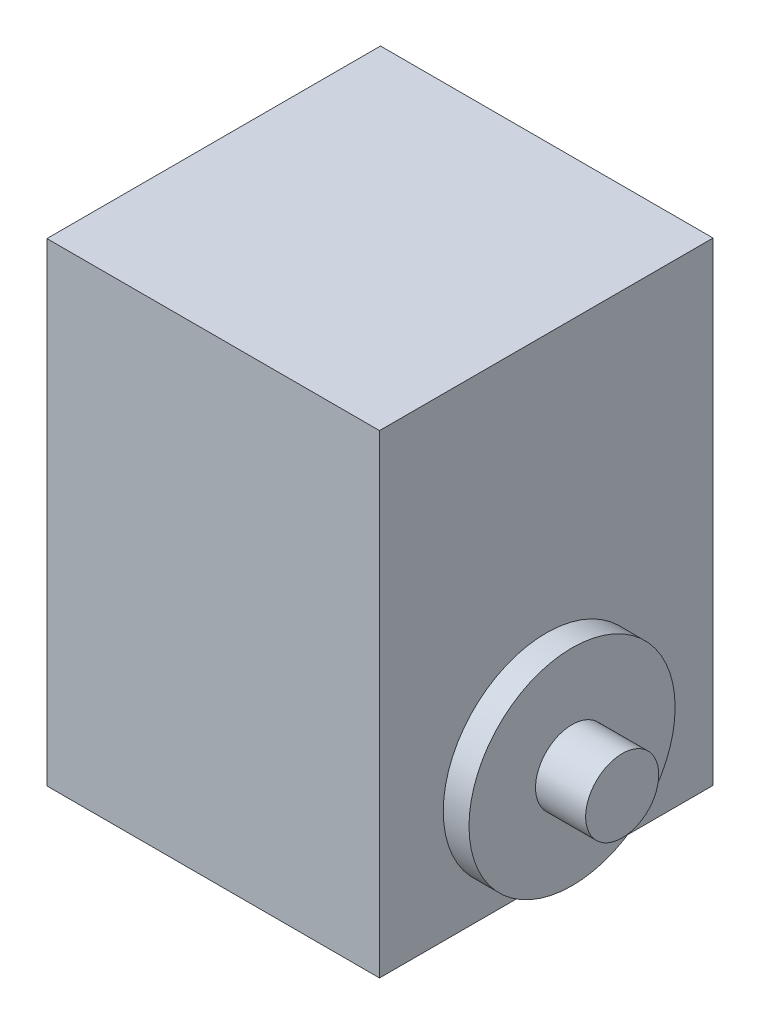
ISO-10303-21;
HEADER;
FILE_DESCRIPTION(('STEP AP214'),'2;1');
FILE_NAME('part.step','',(''),(''),'','','');
FILE_SCHEMA(('AUTOMOTIVE_DESIGN { 1 0 10303 214 1 1 1 1 }'));
ENDSEC;
DATA;
#1=APPLICATION_CONTEXT('core data for automotive mechanical design processes');
#2=APPLICATION_PROTOCOL_DEFINITION('international standard','automotive_design',2000,#1);
#3=PRODUCT_CONTEXT('',#1,'mechanical');
#4=PRODUCT('Part','Part','',(#3));
#5=PRODUCT_RELATED_PRODUCT_CATEGORY('part','',(#4));
#6=PRODUCT_DEFINITION_FORMATION('','',#4);
#7=PRODUCT_DEFINITION_CONTEXT('part definition',#1,'design');
#8=PRODUCT_DEFINITION('design','',#6,#7);
#9=PRODUCT_DEFINITION_SHAPE('','',#8);
#10=(LENGTH_UNIT() NAMED_UNIT(*) SI_UNIT(.MILLI.,.METRE.));
#11=(NAMED_UNIT(*) PLANE_ANGLE_UNIT() SI_UNIT($,.RADIAN.));
#12=(NAMED_UNIT(*) SI_UNIT($,.STERADIAN.) SOLID_ANGLE_UNIT());
#13=UNCERTAINTY_MEASURE_WITH_UNIT(LENGTH_MEASURE(1.E-05),#10,'distance_accuracy_value','');
#14=(GEOMETRIC_REPRESENTATION_CONTEXT(3) GLOBAL_UNCERTAINTY_ASSIGNED_CONTEXT((#13)) GLOBAL_UNIT_ASSIGNED_CONTEXT((#10,
#11,#12)) REPRESENTATION_CONTEXT('',''));
#15=CARTESIAN_POINT('',(0.,0.,0.));
#16=DIRECTION('',(0.,0.,1.));
#17=DIRECTION('',(1.,0.,0.));
#18=AXIS2_PLACEMENT_3D('',#15,#16,#17);
#19=CARTESIAN_POINT('',(20.5,0.,0.));
#20=DIRECTION('',(1.,0.,0.));
#21=DIRECTION('',(0.,0.,-1.));
#22=AXIS2_PLACEMENT_3D('',#19,#20,#21);
#23=PLANE('',#22);
#24=CARTESIAN_POINT('',(20.5,0.,0.));
#25=DIRECTION('',(1.,0.,0.));
#26=DIRECTION('',(0.,0.,-1.));
#27=AXIS2_PLACEMENT_3D('',#24,#25,#26);
#28=CIRCLE('',#27,11.);
#29=CARTESIAN_POINT('',(20.5,0.,-11.));
#30=VERTEX_POINT('',#29);
#31=EDGE_CURVE('E104',#30,#30,#28,.T.);
#32=ORIENTED_EDGE('',*,*,#31,.T.);
#33=EDGE_LOOP('',(#32));
#34=FACE_BOUND('',#33,.T.);
#35=CARTESIAN_POINT('',(20.5,0.,0.));
#36=DIRECTION('',(1.,0.,0.));
#37=DIRECTION('',(0.,0.,-1.));
#38=AXIS2_PLACEMENT_3D('',#35,#36,#37);
#39=CIRCLE('',#38,3.90000000000001);
#40=CARTESIAN_POINT('',(20.5,0.,-3.90000000000001));
#41=VERTEX_POINT('',#40);
#42=EDGE_CURVE('E178',#41,#41,#39,.T.);
#43=ORIENTED_EDGE('',*,*,#42,.F.);
#44=EDGE_LOOP('',(#43));
#45=FACE_BOUND('',#44,.T.);
#46=ADVANCED_FACE('F32',(#34,#45),#23,.T.);
#47=CARTESIAN_POINT('',(17.75,38.6,17.8));
#48=DIRECTION('',(-1.,0.,0.));
#49=DIRECTION('',(0.,0.,1.));
#50=AXIS2_PLACEMENT_3D('',#47,#48,#49);
#51=PLANE('',#50);
#52=DIRECTION('',(0.,0.,-1.));
#53=VECTOR('',#52,1.);
#54=CARTESIAN_POINT('',(17.75,-12.,17.8));
#55=LINE('',#54,#53);
#56=CARTESIAN_POINT('',(17.75,-12.,17.8));
#57=VERTEX_POINT('',#56);
#58=CARTESIAN_POINT('',(17.75,-12.,-17.8));
#59=VERTEX_POINT('',#58);
#60=EDGE_CURVE('E66',#57,#59,#55,.T.);
#61=ORIENTED_EDGE('',*,*,#60,.T.);
#62=DIRECTION('',(0.,-1.,0.));
#63=VECTOR('',#62,1.);
#64=CARTESIAN_POINT('',(17.75,38.6,-17.8));
#65=LINE('',#64,#63);
#66=CARTESIAN_POINT('',(17.75,38.6,-17.8));
#67=VERTEX_POINT('',#66);
#68=EDGE_CURVE('E92',#67,#59,#65,.T.);
#69=ORIENTED_EDGE('',*,*,#68,.F.);
#70=DIRECTION('',(0.,0.,-1.));
#71=VECTOR('',#70,1.);
#72=CARTESIAN_POINT('',(17.75,38.6,17.8));
#73=LINE('',#72,#71);
#74=CARTESIAN_POINT('',(17.75,38.6,17.8));
#75=VERTEX_POINT('',#74);
#76=EDGE_CURVE('E83',#75,#67,#73,.T.);
#77=ORIENTED_EDGE('',*,*,#76,.F.);
#78=DIRECTION('',(0.,-1.,0.));
#79=VECTOR('',#78,1.);
#80=CARTESIAN_POINT('',(17.75,38.6,17.8));
#81=LINE('',#80,#79);
#82=EDGE_CURVE('E88',#75,#57,#81,.T.);
#83=ORIENTED_EDGE('',*,*,#82,.T.);
#84=EDGE_LOOP('',(#61,#69,#77,#83));
#85=FACE_BOUND('',#84,.T.);
#86=CARTESIAN_POINT('',(17.75,0.,0.));
#87=DIRECTION('',(-1.,0.,0.));
#88=DIRECTION('',(0.,0.,1.));
#89=AXIS2_PLACEMENT_3D('',#86,#87,#88);
#90=CIRCLE('',#89,11.);
#91=CARTESIAN_POINT('',(17.75,0.,11.));
#92=VERTEX_POINT('',#91);
#93=EDGE_CURVE('E41',#92,#92,#90,.F.);
#94=ORIENTED_EDGE('',*,*,#93,.F.);
#95=EDGE_LOOP('',(#94));
#96=FACE_BOUND('',#95,.T.);
#97=ADVANCED_FACE('F94',(#85,#96),#51,.F.);
#98=CARTESIAN_POINT('',(-17.75,38.6,17.8));
#99=DIRECTION('',(1.,0.,0.));
#100=DIRECTION('',(0.,0.,-1.));
#101=AXIS2_PLACEMENT_3D('',#98,#99,#100);
#102=PLANE('',#101);
#103=CARTESIAN_POINT('',(-17.75,0.,0.));
#104=DIRECTION('',(1.,0.,0.));
#105=DIRECTION('',(0.,0.,-1.));
#106=AXIS2_PLACEMENT_3D('',#103,#104,#105);
#107=CIRCLE('',#106,11.);
#108=CARTESIAN_POINT('',(-17.75,0.,-11.));
#109=VERTEX_POINT('',#108);
#110=EDGE_CURVE('E171',#109,#109,#107,.T.);
#111=ORIENTED_EDGE('',*,*,#110,.T.);
#112=EDGE_LOOP('',(#111));
#113=FACE_BOUND('',#112,.T.);
#114=DIRECTION('',(0.,0.,1.));
#115=VECTOR('',#114,1.);
#116=CARTESIAN_POINT('',(-17.75,-12.,17.8));
#117=LINE('',#116,#115);
#118=CARTESIAN_POINT('',(-17.75,-12.,-17.8));
#119=VERTEX_POINT('',#118);
#120=CARTESIAN_POINT('',(-17.75,-12.,17.8));
#121=VERTEX_POINT('',#120);
#122=EDGE_CURVE('E101',#119,#121,#117,.T.);
#123=ORIENTED_EDGE('',*,*,#122,.T.);
#124=DIRECTION('',(0.,-1.,0.));
#125=VECTOR('',#124,1.);
#126=CARTESIAN_POINT('',(-17.75,38.6,17.8));
#127=LINE('',#126,#125);
#128=CARTESIAN_POINT('',(-17.75,38.6,17.8));
#129=VERTEX_POINT('',#128);
#130=EDGE_CURVE('E91',#129,#121,#127,.T.);
#131=ORIENTED_EDGE('',*,*,#130,.F.);
#132=DIRECTION('',(0.,0.,1.));
#133=VECTOR('',#132,1.);
#134=CARTESIAN_POINT('',(-17.75,38.6,17.8));
#135=LINE('',#134,#133);
#136=CARTESIAN_POINT('',(-17.75,38.6,-17.8));
#137=VERTEX_POINT('',#136);
#138=EDGE_CURVE('E85',#137,#129,#135,.T.);
#139=ORIENTED_EDGE('',*,*,#138,.F.);
#140=DIRECTION('',(0.,-1.,0.));
#141=VECTOR('',#140,1.);
#142=CARTESIAN_POINT('',(-17.75,38.6,-17.8));
#143=LINE('',#142,#141);
#144=EDGE_CURVE('E97',#137,#119,#143,.T.);
#145=ORIENTED_EDGE('',*,*,#144,.T.);
#146=EDGE_LOOP('',(#123,#131,#139,#145));
#147=FACE_BOUND('',#146,.T.);
#148=ADVANCED_FACE('F34',(#113,#147),#102,.F.);
#149=CARTESIAN_POINT('',(17.75,38.6,17.8));
#150=DIRECTION('',(0.,0.,-1.));
#151=DIRECTION('',(-1.,0.,0.));
#152=AXIS2_PLACEMENT_3D('',#149,#150,#151);
#153=PLANE('',#152);
#154=DIRECTION('',(1.,0.,0.));
#155=VECTOR('',#154,1.);
#156=CARTESIAN_POINT('',(17.75,-12.,17.8));
#157=LINE('',#156,#155);
#158=EDGE_CURVE('E90',#121,#57,#157,.T.);
#159=ORIENTED_EDGE('',*,*,#158,.T.);
#160=ORIENTED_EDGE('',*,*,#82,.F.);
#161=DIRECTION('',(1.,0.,0.));
#162=VECTOR('',#161,1.);
#163=CARTESIAN_POINT('',(17.75,38.6,17.8));
#164=LINE('',#163,#162);
#165=EDGE_CURVE('E80',#129,#75,#164,.T.);
#166=ORIENTED_EDGE('',*,*,#165,.F.);
#167=ORIENTED_EDGE('',*,*,#130,.T.);
#168=EDGE_LOOP('',(#159,#160,#166,#167));
#169=FACE_BOUND('',#168,.T.);
#170=ADVANCED_FACE('F89',(#169),#153,.F.);
#171=CARTESIAN_POINT('',(17.75,38.6,-17.8));
#172=DIRECTION('',(0.,0.,1.));
#173=DIRECTION('',(1.,0.,0.));
#174=AXIS2_PLACEMENT_3D('',#171,#172,#173);
#175=PLANE('',#174);
#176=DIRECTION('',(-1.,0.,0.));
#177=VECTOR('',#176,1.);
#178=CARTESIAN_POINT('',(17.75,-12.,-17.8));
#179=LINE('',#178,#177);
#180=EDGE_CURVE('E72',#59,#119,#179,.T.);
#181=ORIENTED_EDGE('',*,*,#180,.T.);
#182=ORIENTED_EDGE('',*,*,#144,.F.);
#183=DIRECTION('',(-1.,0.,0.));
#184=VECTOR('',#183,1.);
#185=CARTESIAN_POINT('',(17.75,38.6,-17.8));
#186=LINE('',#185,#184);
#187=EDGE_CURVE('E49',#67,#137,#186,.T.);
#188=ORIENTED_EDGE('',*,*,#187,.F.);
#189=ORIENTED_EDGE('',*,*,#68,.T.);
#190=EDGE_LOOP('',(#181,#182,#188,#189));
#191=FACE_BOUND('',#190,.T.);
#192=ADVANCED_FACE('F124',(#191),#175,.F.);
#193=CARTESIAN_POINT('',(-17.75,38.6,-17.8));
#194=DIRECTION('',(0.,1.,0.));
#195=DIRECTION('',(0.,0.,1.));
#196=AXIS2_PLACEMENT_3D('',#193,#194,#195);
#197=PLANE('',#196);
#198=ORIENTED_EDGE('',*,*,#138,.T.);
#199=ORIENTED_EDGE('',*,*,#165,.T.);
#200=ORIENTED_EDGE('',*,*,#76,.T.);
#201=ORIENTED_EDGE('',*,*,#187,.T.);
#202=EDGE_LOOP('',(#198,#199,#200,#201));
#203=FACE_BOUND('',#202,.T.);
#204=ADVANCED_FACE('F81',(#203),#197,.T.);
#205=CARTESIAN_POINT('',(-17.75,-12.,-17.8));
#206=DIRECTION('',(0.,1.,0.));
#207=DIRECTION('',(0.,0.,1.));
#208=AXIS2_PLACEMENT_3D('',#205,#206,#207);
#209=PLANE('',#208);
#210=ORIENTED_EDGE('',*,*,#122,.F.);
#211=ORIENTED_EDGE('',*,*,#180,.F.);
#212=ORIENTED_EDGE('',*,*,#60,.F.);
#213=ORIENTED_EDGE('',*,*,#158,.F.);
#214=EDGE_LOOP('',(#210,#211,#212,#213));
#215=FACE_BOUND('',#214,.T.);
#216=ADVANCED_FACE('F133',(#215),#209,.F.);
#217=CARTESIAN_POINT('',(20.5,0.,0.));
#218=DIRECTION('',(-1.,0.,0.));
#219=DIRECTION('',(0.,0.,1.));
#220=AXIS2_PLACEMENT_3D('',#217,#218,#219);
#221=CYLINDRICAL_SURFACE('',#220,11.);
#222=ORIENTED_EDGE('',*,*,#31,.F.);
#223=EDGE_LOOP('',(#222));
#224=FACE_BOUND('',#223,.T.);
#225=ORIENTED_EDGE('',*,*,#93,.T.);
#226=EDGE_LOOP('',(#225));
#227=FACE_BOUND('',#226,.T.);
#228=ADVANCED_FACE('F113',(#224,#227),#221,.T.);
#229=CARTESIAN_POINT('',(25.85,0.,0.));
#230=DIRECTION('',(-1.,0.,0.));
#231=DIRECTION('',(0.,0.,1.));
#232=AXIS2_PLACEMENT_3D('',#229,#230,#231);
#233=CYLINDRICAL_SURFACE('',#232,3.90000000000001);
#234=CARTESIAN_POINT('',(25.85,0.,0.));
#235=DIRECTION('',(1.,0.,0.));
#236=DIRECTION('',(0.,0.,-1.));
#237=AXIS2_PLACEMENT_3D('',#234,#235,#236);
#238=CIRCLE('',#237,3.90000000000001);
#239=CARTESIAN_POINT('',(25.85,0.,-3.90000000000001));
#240=VERTEX_POINT('',#239);
#241=EDGE_CURVE('E180',#240,#240,#238,.T.);
#242=ORIENTED_EDGE('',*,*,#241,.F.);
#243=EDGE_LOOP('',(#242));
#244=FACE_BOUND('',#243,.T.);
#245=ORIENTED_EDGE('',*,*,#42,.T.);
#246=EDGE_LOOP('',(#245));
#247=FACE_BOUND('',#246,.T.);
#248=ADVANCED_FACE('F141',(#244,#247),#233,.T.);
#249=CARTESIAN_POINT('',(25.85,0.,0.));
#250=DIRECTION('',(1.,0.,0.));
#251=DIRECTION('',(0.,0.,-1.));
#252=AXIS2_PLACEMENT_3D('',#249,#250,#251);
#253=PLANE('',#252);
#254=ORIENTED_EDGE('',*,*,#241,.T.);
#255=EDGE_LOOP('',(#254));
#256=FACE_BOUND('',#255,.T.);
#257=ADVANCED_FACE('F146',(#256),#253,.T.);
#258=CARTESIAN_POINT('',(-20.5,0.,0.));
#259=DIRECTION('',(1.,0.,0.));
#260=DIRECTION('',(0.,0.,-1.));
#261=AXIS2_PLACEMENT_3D('',#258,#259,#260);
#262=CYLINDRICAL_SURFACE('',#261,11.);
#263=CARTESIAN_POINT('',(-20.5,0.,0.));
#264=DIRECTION('',(1.,0.,0.));
#265=DIRECTION('',(0.,0.,-1.));
#266=AXIS2_PLACEMENT_3D('',#263,#264,#265);
#267=CIRCLE('',#266,11.);
#268=CARTESIAN_POINT('',(-20.5,0.,-11.));
#269=VERTEX_POINT('',#268);
#270=EDGE_CURVE('E174',#269,#269,#267,.T.);
#271=ORIENTED_EDGE('',*,*,#270,.T.);
#272=EDGE_LOOP('',(#271));
#273=FACE_BOUND('',#272,.T.);
#274=ORIENTED_EDGE('',*,*,#110,.F.);
#275=EDGE_LOOP('',(#274));
#276=FACE_BOUND('',#275,.T.);
#277=ADVANCED_FACE('F150',(#273,#276),#262,.T.);
#278=CARTESIAN_POINT('',(-20.5,0.,0.));
#279=DIRECTION('',(-1.,0.,0.));
#280=DIRECTION('',(0.,0.,-1.));
#281=AXIS2_PLACEMENT_3D('',#278,#279,#280);
#282=PLANE('',#281);
#283=CARTESIAN_POINT('',(-20.5,0.,0.));
#284=DIRECTION('',(-1.,0.,0.));
#285=DIRECTION('',(0.,0.,1.));
#286=AXIS2_PLACEMENT_3D('',#283,#284,#285);
#287=CIRCLE('',#286,3.90000000000001);
#288=CARTESIAN_POINT('',(-20.5,0.,3.90000000000001));
#289=VERTEX_POINT('',#288);
#290=EDGE_CURVE('E11',#289,#289,#287,.T.);
#291=ORIENTED_EDGE('',*,*,#290,.F.);
#292=EDGE_LOOP('',(#291));
#293=FACE_BOUND('',#292,.T.);
#294=ORIENTED_EDGE('',*,*,#270,.F.);
#295=EDGE_LOOP('',(#294));
#296=FACE_BOUND('',#295,.T.);
#297=ADVANCED_FACE('F154',(#293,#296),#282,.T.);
#298=CARTESIAN_POINT('',(-25.85,0.,0.));
#299=DIRECTION('',(1.,0.,0.));
#300=DIRECTION('',(0.,0.,-1.));
#301=AXIS2_PLACEMENT_3D('',#298,#299,#300);
#302=CYLINDRICAL_SURFACE('',#301,3.90000000000001);
#303=CARTESIAN_POINT('',(-25.85,0.,0.));
#304=DIRECTION('',(1.,0.,0.));
#305=DIRECTION('',(0.,0.,-1.));
#306=AXIS2_PLACEMENT_3D('',#303,#304,#305);
#307=CIRCLE('',#306,3.90000000000001);
#308=CARTESIAN_POINT('',(-25.85,0.,-3.90000000000001));
#309=VERTEX_POINT('',#308);
#310=EDGE_CURVE('E170',#309,#309,#307,.T.);
#311=ORIENTED_EDGE('',*,*,#310,.T.);
#312=EDGE_LOOP('',(#311));
#313=FACE_BOUND('',#312,.T.);
#314=ORIENTED_EDGE('',*,*,#290,.T.);
#315=EDGE_LOOP('',(#314));
#316=FACE_BOUND('',#315,.T.);
#317=ADVANCED_FACE('F158',(#313,#316),#302,.T.);
#318=CARTESIAN_POINT('',(-25.85,0.,0.));
#319=DIRECTION('',(-1.,0.,0.));
#320=DIRECTION('',(0.,0.,-1.));
#321=AXIS2_PLACEMENT_3D('',#318,#319,#320);
#322=PLANE('',#321);
#323=ORIENTED_EDGE('',*,*,#310,.F.);
#324=EDGE_LOOP('',(#323));
#325=FACE_BOUND('',#324,.T.);
#326=ADVANCED_FACE('F162',(#325),#322,.T.);
#327=CLOSED_SHELL('',(#46,#97,#148,#170,#192,#204,#216,#228,#248,#257,#277,#297,#317,#326));
#328=MANIFOLD_SOLID_BREP('B2',#327);
#329=ADVANCED_BREP_SHAPE_REPRESENTATION('',(#18,#328),#14);
#330=SHAPE_DEFINITION_REPRESENTATION(#9,#329);
ENDSEC;
END-ISO-10303-21;
